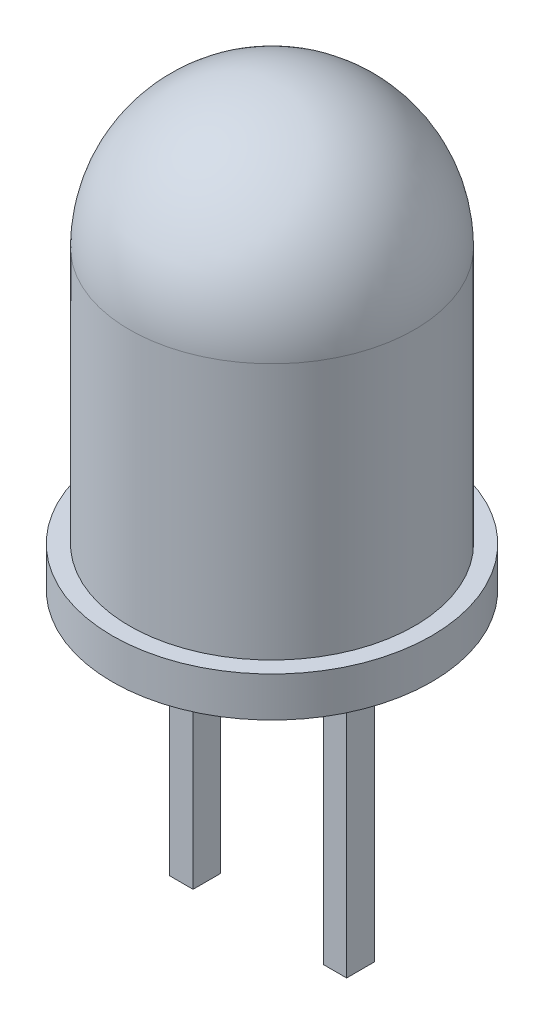
ISO-10303-21;
HEADER;
FILE_DESCRIPTION(('STEP AP214'),'2;1');
FILE_NAME('part.step','',(''),(''),'','','');
FILE_SCHEMA(('AUTOMOTIVE_DESIGN { 1 0 10303 214 1 1 1 1 }'));
ENDSEC;
DATA;
#1=APPLICATION_CONTEXT('core data for automotive mechanical design processes');
#2=APPLICATION_PROTOCOL_DEFINITION('international standard','automotive_design',2000,#1);
#3=PRODUCT_CONTEXT('',#1,'mechanical');
#4=PRODUCT('Part','Part','',(#3));
#5=PRODUCT_RELATED_PRODUCT_CATEGORY('part','',(#4));
#6=PRODUCT_DEFINITION_FORMATION('','',#4);
#7=PRODUCT_DEFINITION_CONTEXT('part definition',#1,'design');
#8=PRODUCT_DEFINITION('design','',#6,#7);
#9=PRODUCT_DEFINITION_SHAPE('','',#8);
#10=(LENGTH_UNIT() NAMED_UNIT(*) SI_UNIT(.MILLI.,.METRE.));
#11=(NAMED_UNIT(*) PLANE_ANGLE_UNIT() SI_UNIT($,.RADIAN.));
#12=(NAMED_UNIT(*) SI_UNIT($,.STERADIAN.) SOLID_ANGLE_UNIT());
#13=UNCERTAINTY_MEASURE_WITH_UNIT(LENGTH_MEASURE(1.E-05),#10,'distance_accuracy_value','');
#14=(GEOMETRIC_REPRESENTATION_CONTEXT(3) GLOBAL_UNCERTAINTY_ASSIGNED_CONTEXT((#13)) GLOBAL_UNIT_ASSIGNED_CONTEXT((#10,
#11,#12)) REPRESENTATION_CONTEXT('',''));
#15=CARTESIAN_POINT('',(0.,0.,0.));
#16=DIRECTION('',(0.,0.,1.));
#17=DIRECTION('',(1.,0.,0.));
#18=AXIS2_PLACEMENT_3D('',#15,#16,#17);
#19=CARTESIAN_POINT('',(0.,-0.7,0.));
#20=DIRECTION('',(0.,-1.,0.));
#21=DIRECTION('',(0.,0.,-1.));
#22=AXIS2_PLACEMENT_3D('',#19,#20,#21);
#23=PLANE('',#22);
#24=DIRECTION('',(-1.,0.,0.));
#25=VECTOR('',#24,1.);
#26=CARTESIAN_POINT('',(1.14190313671731,-0.7,0.242385099774928));
#27=LINE('',#26,#25);
#28=CARTESIAN_POINT('',(1.55126463855937,-0.7,0.242385099774928));
#29=VERTEX_POINT('',#28);
#30=CARTESIAN_POINT('',(1.14190313671731,-0.7,0.242385099774928));
#31=VERTEX_POINT('',#30);
#32=EDGE_CURVE('E128',#29,#31,#27,.T.);
#33=ORIENTED_EDGE('',*,*,#32,.F.);
#34=DIRECTION('',(0.,0.,1.));
#35=VECTOR('',#34,1.);
#36=CARTESIAN_POINT('',(1.55126463855937,-0.7,-0.242385099774928));
#37=LINE('',#36,#35);
#38=CARTESIAN_POINT('',(1.55126463855937,-0.7,-0.242385099774928));
#39=VERTEX_POINT('',#38);
#40=EDGE_CURVE('E125',#39,#29,#37,.T.);
#41=ORIENTED_EDGE('',*,*,#40,.F.);
#42=DIRECTION('',(1.,0.,0.));
#43=VECTOR('',#42,1.);
#44=CARTESIAN_POINT('',(1.14190313671731,-0.7,-0.242385099774928));
#45=LINE('',#44,#43);
#46=CARTESIAN_POINT('',(1.14190313671731,-0.7,-0.242385099774928));
#47=VERTEX_POINT('',#46);
#48=EDGE_CURVE('E137',#47,#39,#45,.T.);
#49=ORIENTED_EDGE('',*,*,#48,.F.);
#50=DIRECTION('',(0.,0.,-1.));
#51=VECTOR('',#50,1.);
#52=CARTESIAN_POINT('',(1.14190313671731,-0.7,-0.242385099774928));
#53=LINE('',#52,#51);
#54=EDGE_CURVE('E145',#31,#47,#53,.T.);
#55=ORIENTED_EDGE('',*,*,#54,.F.);
#56=EDGE_LOOP('',(#33,#41,#49,#55));
#57=FACE_BOUND('',#56,.T.);
#58=CARTESIAN_POINT('',(0.,-0.7,0.));
#59=DIRECTION('',(0.,-1.,0.));
#60=DIRECTION('',(0.,0.,-1.));
#61=AXIS2_PLACEMENT_3D('',#58,#59,#60);
#62=CIRCLE('',#61,2.8);
#63=CARTESIAN_POINT('',(0.,-0.7,-2.8));
#64=VERTEX_POINT('',#63);
#65=EDGE_CURVE('E157',#64,#64,#62,.T.);
#66=ORIENTED_EDGE('',*,*,#65,.T.);
#67=EDGE_LOOP('',(#66));
#68=FACE_BOUND('',#67,.T.);
#69=DIRECTION('',(-1.,0.,0.));
#70=VECTOR('',#69,1.);
#71=CARTESIAN_POINT('',(-1.14190313671731,-0.7,0.242385099774928));
#72=LINE('',#71,#70);
#73=CARTESIAN_POINT('',(-1.14190313671731,-0.7,0.242385099774928));
#74=VERTEX_POINT('',#73);
#75=CARTESIAN_POINT('',(-1.55126463855937,-0.7,0.242385099774928));
#76=VERTEX_POINT('',#75);
#77=EDGE_CURVE('E311',#74,#76,#72,.T.);
#78=ORIENTED_EDGE('',*,*,#77,.F.);
#79=DIRECTION('',(0.,0.,1.));
#80=VECTOR('',#79,1.);
#81=CARTESIAN_POINT('',(-1.14190313671731,-0.7,-0.242385099774928));
#82=LINE('',#81,#80);
#83=CARTESIAN_POINT('',(-1.14190313671731,-0.7,-0.242385099774928));
#84=VERTEX_POINT('',#83);
#85=EDGE_CURVE('E123',#84,#74,#82,.T.);
#86=ORIENTED_EDGE('',*,*,#85,.F.);
#87=DIRECTION('',(1.,0.,0.));
#88=VECTOR('',#87,1.);
#89=CARTESIAN_POINT('',(-1.14190313671731,-0.7,-0.242385099774928));
#90=LINE('',#89,#88);
#91=CARTESIAN_POINT('',(-1.55126463855937,-0.7,-0.242385099774928));
#92=VERTEX_POINT('',#91);
#93=EDGE_CURVE('E119',#92,#84,#90,.T.);
#94=ORIENTED_EDGE('',*,*,#93,.F.);
#95=DIRECTION('',(0.,0.,-1.));
#96=VECTOR('',#95,1.);
#97=CARTESIAN_POINT('',(-1.55126463855937,-0.7,-0.242385099774928));
#98=LINE('',#97,#96);
#99=EDGE_CURVE('E308',#76,#92,#98,.T.);
#100=ORIENTED_EDGE('',*,*,#99,.F.);
#101=EDGE_LOOP('',(#78,#86,#94,#100));
#102=FACE_BOUND('',#101,.T.);
#103=ADVANCED_FACE('F34',(#57,#68,#102),#23,.T.);
#104=CARTESIAN_POINT('',(0.,7.,0.));
#105=DIRECTION('',(0.,-1.,0.));
#106=DIRECTION('',(0.,0.,-1.));
#107=AXIS2_PLACEMENT_3D('',#104,#105,#106);
#108=CYLINDRICAL_SURFACE('',#107,2.5);
#109=CARTESIAN_POINT('',(0.,4.5,0.));
#110=DIRECTION('',(0.,-1.,0.));
#111=DIRECTION('',(0.,0.,-1.));
#112=AXIS2_PLACEMENT_3D('',#109,#110,#111);
#113=CIRCLE('',#112,2.5);
#114=CARTESIAN_POINT('',(0.,4.5,-2.5));
#115=VERTEX_POINT('',#114);
#116=EDGE_CURVE('E11',#115,#115,#113,.T.);
#117=ORIENTED_EDGE('',*,*,#116,.T.);
#118=EDGE_LOOP('',(#117));
#119=FACE_BOUND('',#118,.T.);
#120=CARTESIAN_POINT('',(0.,0.,0.));
#121=DIRECTION('',(0.,-1.,0.));
#122=DIRECTION('',(0.,0.,-1.));
#123=AXIS2_PLACEMENT_3D('',#120,#121,#122);
#124=CIRCLE('',#123,2.5);
#125=CARTESIAN_POINT('',(0.,0.,-2.5));
#126=VERTEX_POINT('',#125);
#127=EDGE_CURVE('E42',#126,#126,#124,.T.);
#128=ORIENTED_EDGE('',*,*,#127,.F.);
#129=EDGE_LOOP('',(#128));
#130=FACE_BOUND('',#129,.T.);
#131=ADVANCED_FACE('F166',(#119,#130),#108,.T.);
#132=CARTESIAN_POINT('',(0.,0.,0.));
#133=DIRECTION('',(0.,-1.,0.));
#134=DIRECTION('',(0.,0.,-1.));
#135=AXIS2_PLACEMENT_3D('',#132,#133,#134);
#136=PLANE('',#135);
#137=CARTESIAN_POINT('',(0.,0.,0.));
#138=DIRECTION('',(0.,-1.,0.));
#139=DIRECTION('',(0.,0.,-1.));
#140=AXIS2_PLACEMENT_3D('',#137,#138,#139);
#141=CIRCLE('',#140,2.8);
#142=CARTESIAN_POINT('',(0.,0.,-2.8));
#143=VERTEX_POINT('',#142);
#144=EDGE_CURVE('E156',#143,#143,#141,.T.);
#145=ORIENTED_EDGE('',*,*,#144,.F.);
#146=EDGE_LOOP('',(#145));
#147=FACE_BOUND('',#146,.T.);
#148=ORIENTED_EDGE('',*,*,#127,.T.);
#149=EDGE_LOOP('',(#148));
#150=FACE_BOUND('',#149,.T.);
#151=ADVANCED_FACE('F164',(#147,#150),#136,.F.);
#152=CARTESIAN_POINT('',(0.,-0.7,0.));
#153=DIRECTION('',(0.,1.,0.));
#154=DIRECTION('',(0.,0.,1.));
#155=AXIS2_PLACEMENT_3D('',#152,#153,#154);
#156=CYLINDRICAL_SURFACE('',#155,2.8);
#157=ORIENTED_EDGE('',*,*,#65,.F.);
#158=EDGE_LOOP('',(#157));
#159=FACE_BOUND('',#158,.T.);
#160=ORIENTED_EDGE('',*,*,#144,.T.);
#161=EDGE_LOOP('',(#160));
#162=FACE_BOUND('',#161,.T.);
#163=ADVANCED_FACE('F173',(#159,#162),#156,.T.);
#164=CARTESIAN_POINT('',(0.,4.5,0.));
#165=DIRECTION('',(0.,0.,1.));
#166=DIRECTION('',(1.,0.,0.));
#167=AXIS2_PLACEMENT_3D('',#164,#165,#166);
#168=SPHERICAL_SURFACE('',#167,2.5);
#169=CARTESIAN_POINT('',(0.,4.5,0.));
#170=DIRECTION('',(0.,-1.,0.));
#171=DIRECTION('',(0.,0.,-1.));
#172=AXIS2_PLACEMENT_3D('',#169,#170,#171);
#173=SPHERICAL_SURFACE('',#172,2.5);
#174=ORIENTED_EDGE('',*,*,#116,.F.);
#175=EDGE_LOOP('',(#174));
#176=FACE_BOUND('',#175,.T.);
#177=ADVANCED_FACE('F36',(#176),#173,.T.);
#178=CARTESIAN_POINT('',(1.55126463855937,-5.7,-0.242385099774928));
#179=DIRECTION('',(-1.,0.,0.));
#180=DIRECTION('',(0.,0.,1.));
#181=AXIS2_PLACEMENT_3D('',#178,#179,#180);
#182=PLANE('',#181);
#183=ORIENTED_EDGE('',*,*,#40,.T.);
#184=DIRECTION('',(0.,1.,0.));
#185=VECTOR('',#184,1.);
#186=CARTESIAN_POINT('',(1.55126463855937,-5.7,0.242385099774928));
#187=LINE('',#186,#185);
#188=CARTESIAN_POINT('',(1.55126463855937,-5.7,0.242385099774928));
#189=VERTEX_POINT('',#188);
#190=EDGE_CURVE('E154',#189,#29,#187,.T.);
#191=ORIENTED_EDGE('',*,*,#190,.F.);
#192=DIRECTION('',(0.,0.,1.));
#193=VECTOR('',#192,1.);
#194=CARTESIAN_POINT('',(1.55126463855937,-5.7,-0.242385099774928));
#195=LINE('',#194,#193);
#196=CARTESIAN_POINT('',(1.55126463855937,-5.7,-0.242385099774928));
#197=VERTEX_POINT('',#196);
#198=EDGE_CURVE('E133',#197,#189,#195,.T.);
#199=ORIENTED_EDGE('',*,*,#198,.F.);
#200=DIRECTION('',(0.,1.,0.));
#201=VECTOR('',#200,1.);
#202=CARTESIAN_POINT('',(1.55126463855937,-5.7,-0.242385099774928));
#203=LINE('',#202,#201);
#204=EDGE_CURVE('E142',#197,#39,#203,.T.);
#205=ORIENTED_EDGE('',*,*,#204,.T.);
#206=EDGE_LOOP('',(#183,#191,#199,#205));
#207=FACE_BOUND('',#206,.T.);
#208=ADVANCED_FACE('F182',(#207),#182,.F.);
#209=CARTESIAN_POINT('',(1.14190313671731,-5.7,0.242385099774928));
#210=DIRECTION('',(0.,0.,-1.));
#211=DIRECTION('',(-1.,0.,0.));
#212=AXIS2_PLACEMENT_3D('',#209,#210,#211);
#213=PLANE('',#212);
#214=ORIENTED_EDGE('',*,*,#32,.T.);
#215=DIRECTION('',(0.,1.,0.));
#216=VECTOR('',#215,1.);
#217=CARTESIAN_POINT('',(1.14190313671731,-5.7,0.242385099774928));
#218=LINE('',#217,#216);
#219=CARTESIAN_POINT('',(1.14190313671731,-5.7,0.242385099774928));
#220=VERTEX_POINT('',#219);
#221=EDGE_CURVE('E151',#220,#31,#218,.T.);
#222=ORIENTED_EDGE('',*,*,#221,.F.);
#223=DIRECTION('',(-1.,0.,0.));
#224=VECTOR('',#223,1.);
#225=CARTESIAN_POINT('',(1.14190313671731,-5.7,0.242385099774928));
#226=LINE('',#225,#224);
#227=EDGE_CURVE('E136',#189,#220,#226,.T.);
#228=ORIENTED_EDGE('',*,*,#227,.F.);
#229=ORIENTED_EDGE('',*,*,#190,.T.);
#230=EDGE_LOOP('',(#214,#222,#228,#229));
#231=FACE_BOUND('',#230,.T.);
#232=ADVANCED_FACE('F185',(#231),#213,.F.);
#233=CARTESIAN_POINT('',(1.14190313671731,-5.7,-0.242385099774928));
#234=DIRECTION('',(1.,0.,0.));
#235=DIRECTION('',(0.,0.,-1.));
#236=AXIS2_PLACEMENT_3D('',#233,#234,#235);
#237=PLANE('',#236);
#238=ORIENTED_EDGE('',*,*,#54,.T.);
#239=DIRECTION('',(0.,1.,0.));
#240=VECTOR('',#239,1.);
#241=CARTESIAN_POINT('',(1.14190313671731,-5.7,-0.242385099774928));
#242=LINE('',#241,#240);
#243=CARTESIAN_POINT('',(1.14190313671731,-5.7,-0.242385099774928));
#244=VERTEX_POINT('',#243);
#245=EDGE_CURVE('E57',#244,#47,#242,.T.);
#246=ORIENTED_EDGE('',*,*,#245,.F.);
#247=DIRECTION('',(0.,0.,-1.));
#248=VECTOR('',#247,1.);
#249=CARTESIAN_POINT('',(1.14190313671731,-5.7,-0.242385099774928));
#250=LINE('',#249,#248);
#251=EDGE_CURVE('E139',#220,#244,#250,.T.);
#252=ORIENTED_EDGE('',*,*,#251,.F.);
#253=ORIENTED_EDGE('',*,*,#221,.T.);
#254=EDGE_LOOP('',(#238,#246,#252,#253));
#255=FACE_BOUND('',#254,.T.);
#256=ADVANCED_FACE('F189',(#255),#237,.F.);
#257=CARTESIAN_POINT('',(1.14190313671731,-5.7,-0.242385099774928));
#258=DIRECTION('',(0.,0.,1.));
#259=DIRECTION('',(1.,0.,0.));
#260=AXIS2_PLACEMENT_3D('',#257,#258,#259);
#261=PLANE('',#260);
#262=ORIENTED_EDGE('',*,*,#48,.T.);
#263=ORIENTED_EDGE('',*,*,#204,.F.);
#264=DIRECTION('',(1.,0.,0.));
#265=VECTOR('',#264,1.);
#266=CARTESIAN_POINT('',(1.14190313671731,-5.7,-0.242385099774928));
#267=LINE('',#266,#265);
#268=EDGE_CURVE('E141',#244,#197,#267,.T.);
#269=ORIENTED_EDGE('',*,*,#268,.F.);
#270=ORIENTED_EDGE('',*,*,#245,.T.);
#271=EDGE_LOOP('',(#262,#263,#269,#270));
#272=FACE_BOUND('',#271,.T.);
#273=ADVANCED_FACE('F193',(#272),#261,.F.);
#274=CARTESIAN_POINT('',(1.55126463855937,-5.7,0.242385099774928));
#275=DIRECTION('',(0.,1.,0.));
#276=DIRECTION('',(0.,0.,1.));
#277=AXIS2_PLACEMENT_3D('',#274,#275,#276);
#278=PLANE('',#277);
#279=ORIENTED_EDGE('',*,*,#198,.T.);
#280=ORIENTED_EDGE('',*,*,#227,.T.);
#281=ORIENTED_EDGE('',*,*,#251,.T.);
#282=ORIENTED_EDGE('',*,*,#268,.T.);
#283=EDGE_LOOP('',(#279,#280,#281,#282));
#284=FACE_BOUND('',#283,.T.);
#285=ADVANCED_FACE('F197',(#284),#278,.F.);
#286=CARTESIAN_POINT('',(-1.14190313671731,-5.7,-0.242385099774928));
#287=DIRECTION('',(-1.,0.,0.));
#288=DIRECTION('',(0.,0.,1.));
#289=AXIS2_PLACEMENT_3D('',#286,#287,#288);
#290=PLANE('',#289);
#291=ORIENTED_EDGE('',*,*,#85,.T.);
#292=DIRECTION('',(0.,1.,0.));
#293=VECTOR('',#292,1.);
#294=CARTESIAN_POINT('',(-1.14190313671731,-5.7,0.242385099774928));
#295=LINE('',#294,#293);
#296=CARTESIAN_POINT('',(-1.14190313671731,-5.7,0.242385099774928));
#297=VERTEX_POINT('',#296);
#298=EDGE_CURVE('E104',#297,#74,#295,.T.);
#299=ORIENTED_EDGE('',*,*,#298,.F.);
#300=DIRECTION('',(0.,0.,1.));
#301=VECTOR('',#300,1.);
#302=CARTESIAN_POINT('',(-1.14190313671731,-5.7,-0.242385099774928));
#303=LINE('',#302,#301);
#304=CARTESIAN_POINT('',(-1.14190313671731,-5.7,-0.242385099774928));
#305=VERTEX_POINT('',#304);
#306=EDGE_CURVE('E111',#305,#297,#303,.T.);
#307=ORIENTED_EDGE('',*,*,#306,.F.);
#308=DIRECTION('',(0.,1.,0.));
#309=VECTOR('',#308,1.);
#310=CARTESIAN_POINT('',(-1.14190313671731,-5.7,-0.242385099774928));
#311=LINE('',#310,#309);
#312=EDGE_CURVE('E305',#305,#84,#311,.T.);
#313=ORIENTED_EDGE('',*,*,#312,.T.);
#314=EDGE_LOOP('',(#291,#299,#307,#313));
#315=FACE_BOUND('',#314,.T.);
#316=ADVANCED_FACE('F121',(#315),#290,.F.);
#317=CARTESIAN_POINT('',(-1.14190313671731,-5.7,0.242385099774928));
#318=DIRECTION('',(0.,0.,-1.));
#319=DIRECTION('',(-1.,0.,0.));
#320=AXIS2_PLACEMENT_3D('',#317,#318,#319);
#321=PLANE('',#320);
#322=ORIENTED_EDGE('',*,*,#77,.T.);
#323=DIRECTION('',(0.,1.,0.));
#324=VECTOR('',#323,1.);
#325=CARTESIAN_POINT('',(-1.55126463855937,-5.7,0.242385099774928));
#326=LINE('',#325,#324);
#327=CARTESIAN_POINT('',(-1.55126463855937,-5.7,0.242385099774928));
#328=VERTEX_POINT('',#327);
#329=EDGE_CURVE('E107',#328,#76,#326,.T.);
#330=ORIENTED_EDGE('',*,*,#329,.F.);
#331=DIRECTION('',(-1.,0.,0.));
#332=VECTOR('',#331,1.);
#333=CARTESIAN_POINT('',(-1.14190313671731,-5.7,0.242385099774928));
#334=LINE('',#333,#332);
#335=EDGE_CURVE('E100',#297,#328,#334,.T.);
#336=ORIENTED_EDGE('',*,*,#335,.F.);
#337=ORIENTED_EDGE('',*,*,#298,.T.);
#338=EDGE_LOOP('',(#322,#330,#336,#337));
#339=FACE_BOUND('',#338,.T.);
#340=ADVANCED_FACE('F102',(#339),#321,.F.);
#341=CARTESIAN_POINT('',(-1.55126463855937,-5.7,-0.242385099774928));
#342=DIRECTION('',(1.,0.,0.));
#343=DIRECTION('',(0.,0.,-1.));
#344=AXIS2_PLACEMENT_3D('',#341,#342,#343);
#345=PLANE('',#344);
#346=ORIENTED_EDGE('',*,*,#99,.T.);
#347=DIRECTION('',(0.,1.,0.));
#348=VECTOR('',#347,1.);
#349=CARTESIAN_POINT('',(-1.55126463855937,-5.7,-0.242385099774928));
#350=LINE('',#349,#348);
#351=CARTESIAN_POINT('',(-1.55126463855937,-5.7,-0.242385099774928));
#352=VERTEX_POINT('',#351);
#353=EDGE_CURVE('E49',#352,#92,#350,.T.);
#354=ORIENTED_EDGE('',*,*,#353,.F.);
#355=DIRECTION('',(0.,0.,-1.));
#356=VECTOR('',#355,1.);
#357=CARTESIAN_POINT('',(-1.55126463855937,-5.7,-0.242385099774928));
#358=LINE('',#357,#356);
#359=EDGE_CURVE('E110',#328,#352,#358,.T.);
#360=ORIENTED_EDGE('',*,*,#359,.F.);
#361=ORIENTED_EDGE('',*,*,#329,.T.);
#362=EDGE_LOOP('',(#346,#354,#360,#361));
#363=FACE_BOUND('',#362,.T.);
#364=ADVANCED_FACE('F205',(#363),#345,.F.);
#365=CARTESIAN_POINT('',(-1.14190313671731,-5.7,-0.242385099774928));
#366=DIRECTION('',(0.,0.,1.));
#367=DIRECTION('',(1.,0.,0.));
#368=AXIS2_PLACEMENT_3D('',#365,#366,#367);
#369=PLANE('',#368);
#370=ORIENTED_EDGE('',*,*,#93,.T.);
#371=ORIENTED_EDGE('',*,*,#312,.F.);
#372=DIRECTION('',(1.,0.,0.));
#373=VECTOR('',#372,1.);
#374=CARTESIAN_POINT('',(-1.14190313671731,-5.7,-0.242385099774928));
#375=LINE('',#374,#373);
#376=EDGE_CURVE('E115',#352,#305,#375,.T.);
#377=ORIENTED_EDGE('',*,*,#376,.F.);
#378=ORIENTED_EDGE('',*,*,#353,.T.);
#379=EDGE_LOOP('',(#370,#371,#377,#378));
#380=FACE_BOUND('',#379,.T.);
#381=ADVANCED_FACE('F208',(#380),#369,.F.);
#382=CARTESIAN_POINT('',(-1.14190313671731,-5.7,0.242385099774928));
#383=DIRECTION('',(0.,-1.,0.));
#384=DIRECTION('',(0.,0.,-1.));
#385=AXIS2_PLACEMENT_3D('',#382,#383,#384);
#386=PLANE('',#385);
#387=ORIENTED_EDGE('',*,*,#306,.T.);
#388=ORIENTED_EDGE('',*,*,#335,.T.);
#389=ORIENTED_EDGE('',*,*,#359,.T.);
#390=ORIENTED_EDGE('',*,*,#376,.T.);
#391=EDGE_LOOP('',(#387,#388,#389,#390));
#392=FACE_BOUND('',#391,.T.);
#393=ADVANCED_FACE('F114',(#392),#386,.T.);
#394=CLOSED_SHELL('',(#103,#131,#151,#163,#177,#208,#232,#256,#273,#285,#316,#340,#364,#381,#393));
#395=MANIFOLD_SOLID_BREP('B2',#394);
#396=ADVANCED_BREP_SHAPE_REPRESENTATION('',(#18,#395),#14);
#397=SHAPE_DEFINITION_REPRESENTATION(#9,#396);
ENDSEC;
END-ISO-10303-21;
